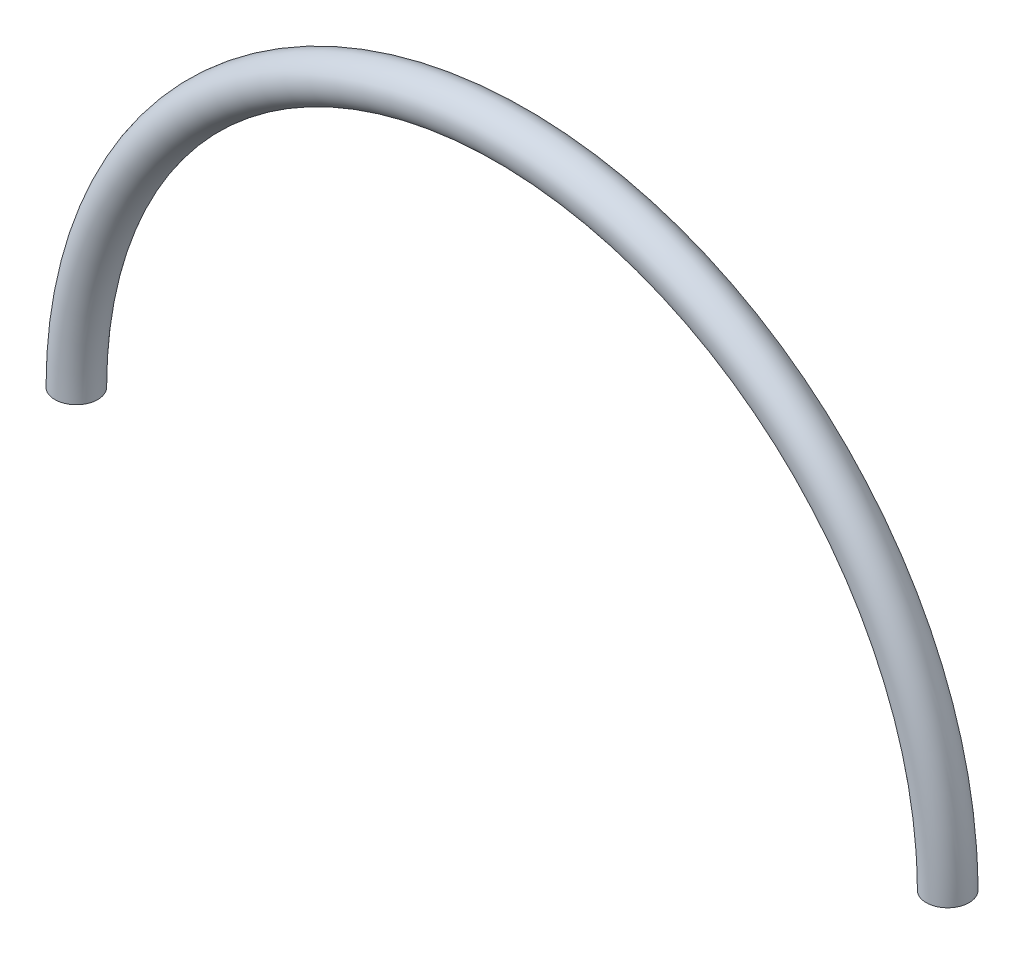
ISO-10303-21;
HEADER;
FILE_DESCRIPTION(('STEP AP214'),'2;1');
FILE_NAME('part.step','',(''),(''),'','','');
FILE_SCHEMA(('AUTOMOTIVE_DESIGN { 1 0 10303 214 1 1 1 1 }'));
ENDSEC;
DATA;
#1=APPLICATION_CONTEXT('core data for automotive mechanical design processes');
#2=APPLICATION_PROTOCOL_DEFINITION('international standard','automotive_design',2000,#1);
#3=PRODUCT_CONTEXT('',#1,'mechanical');
#4=PRODUCT('Part','Part','',(#3));
#5=PRODUCT_RELATED_PRODUCT_CATEGORY('part','',(#4));
#6=PRODUCT_DEFINITION_FORMATION('','',#4);
#7=PRODUCT_DEFINITION_CONTEXT('part definition',#1,'design');
#8=PRODUCT_DEFINITION('design','',#6,#7);
#9=PRODUCT_DEFINITION_SHAPE('','',#8);
#10=(LENGTH_UNIT() NAMED_UNIT(*) SI_UNIT(.MILLI.,.METRE.));
#11=(NAMED_UNIT(*) PLANE_ANGLE_UNIT() SI_UNIT($,.RADIAN.));
#12=(NAMED_UNIT(*) SI_UNIT($,.STERADIAN.) SOLID_ANGLE_UNIT());
#13=UNCERTAINTY_MEASURE_WITH_UNIT(LENGTH_MEASURE(1.E-05),#10,'distance_accuracy_value','');
#14=(GEOMETRIC_REPRESENTATION_CONTEXT(3) GLOBAL_UNCERTAINTY_ASSIGNED_CONTEXT((#13)) GLOBAL_UNIT_ASSIGNED_CONTEXT((#10,
#11,#12)) REPRESENTATION_CONTEXT('',''));
#15=CARTESIAN_POINT('',(0.,0.,0.));
#16=DIRECTION('',(0.,0.,1.));
#17=DIRECTION('',(1.,0.,0.));
#18=AXIS2_PLACEMENT_3D('',#15,#16,#17);
#19=CARTESIAN_POINT('',(0.,0.,0.));
#20=DIRECTION('',(0.,1.,0.));
#21=DIRECTION('',(0.,0.,1.));
#22=AXIS2_PLACEMENT_3D('',#19,#20,#21);
#23=PLANE('',#22);
#24=CARTESIAN_POINT('',(0.,0.,0.));
#25=DIRECTION('',(0.,1.,0.));
#26=DIRECTION('',(0.,0.,1.));
#27=AXIS2_PLACEMENT_3D('',#24,#25,#26);
#28=CIRCLE('',#27,3.175);
#29=CARTESIAN_POINT('',(0.,0.,3.175));
#30=VERTEX_POINT('',#29);
#31=EDGE_CURVE('E40',#30,#30,#28,.T.);
#32=ORIENTED_EDGE('',*,*,#31,.F.);
#33=EDGE_LOOP('',(#32));
#34=FACE_BOUND('',#33,.T.);
#35=ADVANCED_FACE('F33',(#34),#23,.F.);
#36=CARTESIAN_POINT('',(129.,0.,0.));
#37=DIRECTION('',(0.,-1.,0.));
#38=DIRECTION('',(0.,0.,1.));
#39=AXIS2_PLACEMENT_3D('',#36,#37,#38);
#40=PLANE('',#39);
#41=CARTESIAN_POINT('',(129.,0.,0.));
#42=DIRECTION('',(0.,-1.,0.));
#43=DIRECTION('',(0.,0.,1.));
#44=AXIS2_PLACEMENT_3D('',#41,#42,#43);
#45=CIRCLE('',#44,3.175);
#46=CARTESIAN_POINT('',(129.,0.,3.175));
#47=VERTEX_POINT('',#46);
#48=EDGE_CURVE('E11',#47,#47,#45,.T.);
#49=ORIENTED_EDGE('',*,*,#48,.T.);
#50=EDGE_LOOP('',(#49));
#51=FACE_BOUND('',#50,.T.);
#52=ADVANCED_FACE('F47',(#51),#40,.T.);
#53=CARTESIAN_POINT('',(64.5,0.,0.));
#54=DIRECTION('',(0.,0.,-1.));
#55=DIRECTION('',(-1.,0.,0.));
#56=AXIS2_PLACEMENT_3D('',#53,#54,#55);
#57=TOROIDAL_SURFACE('',#56,64.5,3.175);
#58=ORIENTED_EDGE('',*,*,#48,.F.);
#59=EDGE_LOOP('',(#58));
#60=FACE_BOUND('',#59,.T.);
#61=ORIENTED_EDGE('',*,*,#31,.T.);
#62=EDGE_LOOP('',(#61));
#63=FACE_BOUND('',#62,.T.);
#64=ADVANCED_FACE('F49',(#60,#63),#57,.T.);
#65=CLOSED_SHELL('',(#35,#52,#64));
#66=MANIFOLD_SOLID_BREP('B2',#65);
#67=ADVANCED_BREP_SHAPE_REPRESENTATION('',(#18,#66),#14);
#68=SHAPE_DEFINITION_REPRESENTATION(#9,#67);
ENDSEC;
END-ISO-10303-21;
